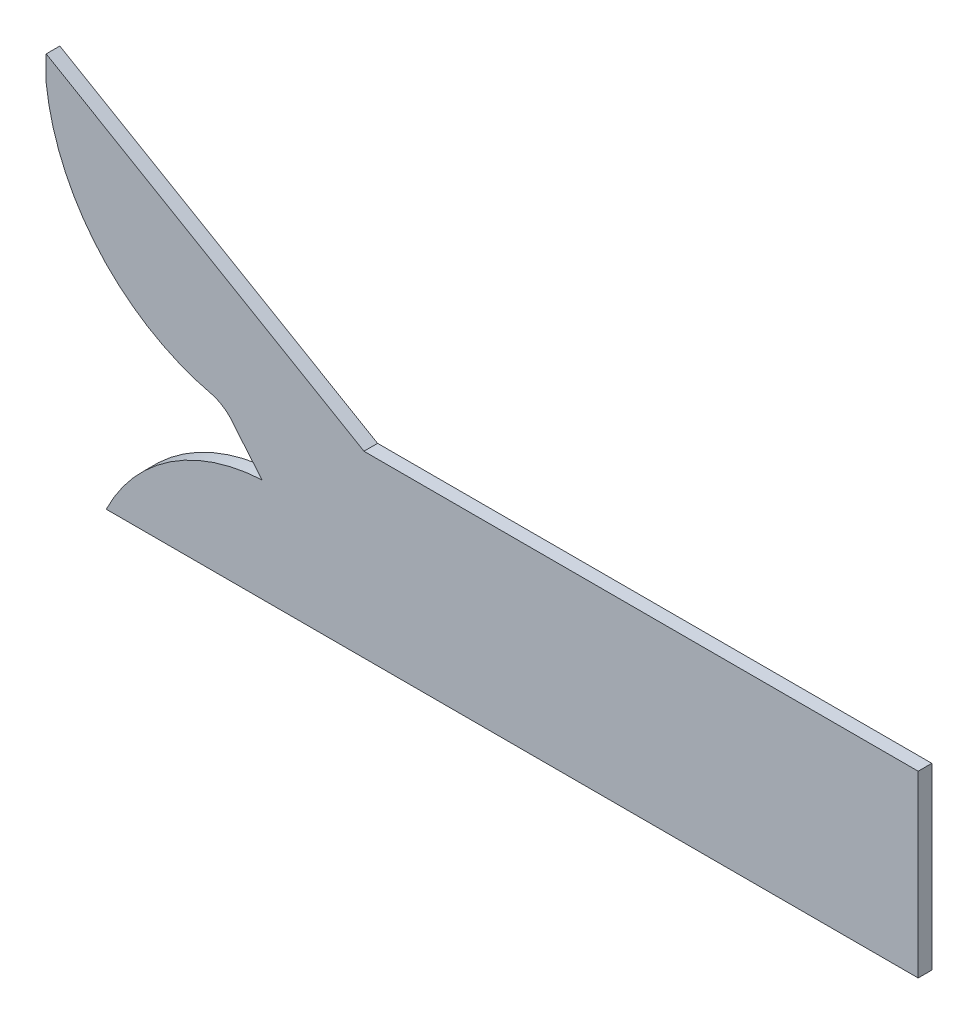
ISO-10303-21;
HEADER;
FILE_DESCRIPTION(('STEP AP214'),'2;1');
FILE_NAME('part.step','',(''),(''),'','','');
FILE_SCHEMA(('AUTOMOTIVE_DESIGN { 1 0 10303 214 1 1 1 1 }'));
ENDSEC;
DATA;
#1=APPLICATION_CONTEXT('core data for automotive mechanical design processes');
#2=APPLICATION_PROTOCOL_DEFINITION('international standard','automotive_design',2000,#1);
#3=PRODUCT_CONTEXT('',#1,'mechanical');
#4=PRODUCT('Part','Part','',(#3));
#5=PRODUCT_RELATED_PRODUCT_CATEGORY('part','',(#4));
#6=PRODUCT_DEFINITION_FORMATION('','',#4);
#7=PRODUCT_DEFINITION_CONTEXT('part definition',#1,'design');
#8=PRODUCT_DEFINITION('design','',#6,#7);
#9=PRODUCT_DEFINITION_SHAPE('','',#8);
#10=(LENGTH_UNIT() NAMED_UNIT(*) SI_UNIT(.MILLI.,.METRE.));
#11=(NAMED_UNIT(*) PLANE_ANGLE_UNIT() SI_UNIT($,.RADIAN.));
#12=(NAMED_UNIT(*) SI_UNIT($,.STERADIAN.) SOLID_ANGLE_UNIT());
#13=UNCERTAINTY_MEASURE_WITH_UNIT(LENGTH_MEASURE(1.E-05),#10,'distance_accuracy_value','');
#14=(GEOMETRIC_REPRESENTATION_CONTEXT(3) GLOBAL_UNCERTAINTY_ASSIGNED_CONTEXT((#13)) GLOBAL_UNIT_ASSIGNED_CONTEXT((#10,
#11,#12)) REPRESENTATION_CONTEXT('',''));
#15=CARTESIAN_POINT('',(0.,0.,0.));
#16=DIRECTION('',(0.,0.,1.));
#17=DIRECTION('',(1.,0.,0.));
#18=AXIS2_PLACEMENT_3D('',#15,#16,#17);
#19=CARTESIAN_POINT('',(-1456.5,672.75,33.45));
#20=DIRECTION('',(1.,0.,0.));
#21=DIRECTION('',(0.,1.,0.));
#22=AXIS2_PLACEMENT_3D('',#19,#20,#21);
#23=PLANE('',#22);
#24=DIRECTION('',(0.,0.,1.));
#25=VECTOR('',#24,1.);
#26=CARTESIAN_POINT('',(-1456.5,611.282881012337,3.17801340798951E-12));
#27=LINE('',#26,#25);
#28=CARTESIAN_POINT('',(-1456.5,611.282881012335,33.45));
#29=VERTEX_POINT('',#28);
#30=CARTESIAN_POINT('',(-1456.5,611.282881012337,-5.13246526796551E-13));
#31=VERTEX_POINT('',#30);
#32=EDGE_CURVE('E96',#29,#31,#27,.F.);
#33=ORIENTED_EDGE('',*,*,#32,.F.);
#34=DIRECTION('',(0.,-1.,0.));
#35=VECTOR('',#34,1.);
#36=CARTESIAN_POINT('',(-1456.5,672.75,33.45));
#37=LINE('',#36,#35);
#38=CARTESIAN_POINT('',(-1456.5,672.75,33.45));
#39=VERTEX_POINT('',#38);
#40=EDGE_CURVE('E147',#39,#29,#37,.T.);
#41=ORIENTED_EDGE('',*,*,#40,.F.);
#42=DIRECTION('',(0.,0.,-1.));
#43=VECTOR('',#42,1.);
#44=CARTESIAN_POINT('',(-1456.5,672.75,33.45));
#45=LINE('',#44,#43);
#46=CARTESIAN_POINT('',(-1456.5,672.75,0.));
#47=VERTEX_POINT('',#46);
#48=EDGE_CURVE('E144',#39,#47,#45,.T.);
#49=ORIENTED_EDGE('',*,*,#48,.T.);
#50=DIRECTION('',(0.,-1.,0.));
#51=VECTOR('',#50,1.);
#52=CARTESIAN_POINT('',(-1456.5,672.75,0.));
#53=LINE('',#52,#51);
#54=EDGE_CURVE('E218',#47,#31,#53,.T.);
#55=ORIENTED_EDGE('',*,*,#54,.T.);
#56=EDGE_LOOP('',(#33,#41,#49,#55));
#57=FACE_BOUND('',#56,.T.);
#58=ADVANCED_FACE('F46',(#57),#23,.F.);
#59=CARTESIAN_POINT('',(678.5,219.25,33.45));
#60=DIRECTION('',(-1.,0.,0.));
#61=DIRECTION('',(0.,-1.,0.));
#62=AXIS2_PLACEMENT_3D('',#59,#60,#61);
#63=PLANE('',#62);
#64=DIRECTION('',(0.,1.,0.));
#65=VECTOR('',#64,1.);
#66=CARTESIAN_POINT('',(678.5,219.25,0.));
#67=LINE('',#66,#65);
#68=CARTESIAN_POINT('',(678.5,-219.25,0.));
#69=VERTEX_POINT('',#68);
#70=CARTESIAN_POINT('',(678.5,219.25,0.));
#71=VERTEX_POINT('',#70);
#72=EDGE_CURVE('E211',#69,#71,#67,.T.);
#73=ORIENTED_EDGE('',*,*,#72,.T.);
#74=DIRECTION('',(0.,0.,-1.));
#75=VECTOR('',#74,1.);
#76=CARTESIAN_POINT('',(678.5,219.25,33.45));
#77=LINE('',#76,#75);
#78=CARTESIAN_POINT('',(678.5,219.25,33.45));
#79=VERTEX_POINT('',#78);
#80=EDGE_CURVE('E223',#79,#71,#77,.T.);
#81=ORIENTED_EDGE('',*,*,#80,.F.);
#82=DIRECTION('',(0.,1.,0.));
#83=VECTOR('',#82,1.);
#84=CARTESIAN_POINT('',(678.5,219.25,33.45));
#85=LINE('',#84,#83);
#86=CARTESIAN_POINT('',(678.5,-219.25,33.45));
#87=VERTEX_POINT('',#86);
#88=EDGE_CURVE('E128',#87,#79,#85,.T.);
#89=ORIENTED_EDGE('',*,*,#88,.F.);
#90=DIRECTION('',(0.,0.,-1.));
#91=VECTOR('',#90,1.);
#92=CARTESIAN_POINT('',(678.5,-219.25,33.45));
#93=LINE('',#92,#91);
#94=EDGE_CURVE('E216',#87,#69,#93,.T.);
#95=ORIENTED_EDGE('',*,*,#94,.T.);
#96=EDGE_LOOP('',(#73,#81,#89,#95));
#97=FACE_BOUND('',#96,.T.);
#98=ADVANCED_FACE('F230',(#97),#63,.F.);
#99=CARTESIAN_POINT('',(-678.5,219.25,33.45));
#100=DIRECTION('',(0.,-1.,0.));
#101=DIRECTION('',(0.,0.,-1.));
#102=AXIS2_PLACEMENT_3D('',#99,#100,#101);
#103=PLANE('',#102);
#104=DIRECTION('',(-1.,0.,0.));
#105=VECTOR('',#104,1.);
#106=CARTESIAN_POINT('',(-678.5,219.25,0.));
#107=LINE('',#106,#105);
#108=CARTESIAN_POINT('',(-678.5,219.25,0.));
#109=VERTEX_POINT('',#108);
#110=EDGE_CURVE('E105',#71,#109,#107,.T.);
#111=ORIENTED_EDGE('',*,*,#110,.T.);
#112=DIRECTION('',(0.,0.,-1.));
#113=VECTOR('',#112,1.);
#114=CARTESIAN_POINT('',(-678.5,219.25,33.45));
#115=LINE('',#114,#113);
#116=CARTESIAN_POINT('',(-678.5,219.25,33.45));
#117=VERTEX_POINT('',#116);
#118=EDGE_CURVE('E134',#117,#109,#115,.T.);
#119=ORIENTED_EDGE('',*,*,#118,.F.);
#120=DIRECTION('',(-1.,0.,0.));
#121=VECTOR('',#120,1.);
#122=CARTESIAN_POINT('',(-678.5,219.25,33.45));
#123=LINE('',#122,#121);
#124=EDGE_CURVE('E121',#79,#117,#123,.T.);
#125=ORIENTED_EDGE('',*,*,#124,.F.);
#126=ORIENTED_EDGE('',*,*,#80,.T.);
#127=EDGE_LOOP('',(#111,#119,#125,#126));
#128=FACE_BOUND('',#127,.T.);
#129=ADVANCED_FACE('F135',(#128),#103,.F.);
#130=CARTESIAN_POINT('',(-678.5,219.25,33.45));
#131=DIRECTION('',(-0.503594822523907,-0.863939960140237,0.));
#132=DIRECTION('',(0.863939960140237,-0.503594822523907,0.));
#133=AXIS2_PLACEMENT_3D('',#130,#131,#132);
#134=PLANE('',#133);
#135=DIRECTION('',(-0.863939960140237,0.503594822523907,0.));
#136=VECTOR('',#135,1.);
#137=CARTESIAN_POINT('',(-678.5,219.25,0.));
#138=LINE('',#137,#136);
#139=EDGE_CURVE('E140',#109,#47,#138,.T.);
#140=ORIENTED_EDGE('',*,*,#139,.T.);
#141=ORIENTED_EDGE('',*,*,#48,.F.);
#142=DIRECTION('',(-0.863939960140237,0.503594822523907,0.));
#143=VECTOR('',#142,1.);
#144=CARTESIAN_POINT('',(-678.5,219.25,33.45));
#145=LINE('',#144,#143);
#146=EDGE_CURVE('E125',#117,#39,#145,.T.);
#147=ORIENTED_EDGE('',*,*,#146,.F.);
#148=ORIENTED_EDGE('',*,*,#118,.T.);
#149=EDGE_LOOP('',(#140,#141,#147,#148));
#150=FACE_BOUND('',#149,.T.);
#151=ADVANCED_FACE('F142',(#150),#134,.F.);
#152=CARTESIAN_POINT('',(-678.5,-219.25,33.45));
#153=DIRECTION('',(0.,1.,0.));
#154=DIRECTION('',(0.,0.,1.));
#155=AXIS2_PLACEMENT_3D('',#152,#153,#154);
#156=PLANE('',#155);
#157=DIRECTION('',(1.,0.,0.));
#158=VECTOR('',#157,1.);
#159=CARTESIAN_POINT('',(-1456.5,-219.25,33.45));
#160=LINE('',#159,#158);
#161=CARTESIAN_POINT('',(-1309.43889327958,-219.25,33.45));
#162=VERTEX_POINT('',#161);
#163=EDGE_CURVE('E155',#162,#87,#160,.T.);
#164=ORIENTED_EDGE('',*,*,#163,.F.);
#165=DIRECTION('',(0.,0.,1.));
#166=VECTOR('',#165,1.);
#167=CARTESIAN_POINT('',(-1309.43889327958,-219.25,-0.00100000000051448));
#168=LINE('',#167,#166);
#169=CARTESIAN_POINT('',(-1309.43889327958,-219.25,0.));
#170=VERTEX_POINT('',#169);
#171=EDGE_CURVE('E199',#170,#162,#168,.T.);
#172=ORIENTED_EDGE('',*,*,#171,.F.);
#173=DIRECTION('',(1.,0.,0.));
#174=VECTOR('',#173,1.);
#175=CARTESIAN_POINT('',(-678.5,-219.25,0.));
#176=LINE('',#175,#174);
#177=EDGE_CURVE('E139',#170,#69,#176,.T.);
#178=ORIENTED_EDGE('',*,*,#177,.T.);
#179=ORIENTED_EDGE('',*,*,#94,.F.);
#180=EDGE_LOOP('',(#164,#172,#178,#179));
#181=FACE_BOUND('',#180,.T.);
#182=ADVANCED_FACE('F205',(#181),#156,.F.);
#183=CARTESIAN_POINT('',(0.,0.,33.45));
#184=DIRECTION('',(0.,0.,1.));
#185=DIRECTION('',(1.,0.,0.));
#186=AXIS2_PLACEMENT_3D('',#183,#184,#185);
#187=PLANE('',#186);
#188=CARTESIAN_POINT('',(-904.577879876999,-415.687165085005,33.45));
#189=DIRECTION('',(0.,0.,1.));
#190=DIRECTION('',(1.,0.,0.));
#191=AXIS2_PLACEMENT_3D('',#188,#189,#190);
#192=CIRCLE('',#191,450.);
#193=CARTESIAN_POINT('',(-927.890567991816,33.7085609436943,33.45));
#194=VERTEX_POINT('',#193);
#195=EDGE_CURVE('E80',#194,#162,#192,.T.);
#196=ORIENTED_EDGE('',*,*,#195,.T.);
#197=ORIENTED_EDGE('',*,*,#163,.T.);
#198=ORIENTED_EDGE('',*,*,#88,.T.);
#199=ORIENTED_EDGE('',*,*,#124,.T.);
#200=ORIENTED_EDGE('',*,*,#146,.T.);
#201=ORIENTED_EDGE('',*,*,#40,.T.);
#202=CARTESIAN_POINT('',(-927.890567991816,671.250108662018,33.45));
#203=DIRECTION('',(0.,0.,1.));
#204=DIRECTION('',(1.,0.,0.));
#205=AXIS2_PLACEMENT_3D('',#202,#203,#204);
#206=CIRCLE('',#205,532.);
#207=CARTESIAN_POINT('',(-1048.42198546556,153.083940911006,33.45));
#208=VERTEX_POINT('',#207);
#209=EDGE_CURVE('E88',#29,#208,#206,.T.);
#210=ORIENTED_EDGE('',*,*,#209,.T.);
#211=CARTESIAN_POINT('',(-1077.81105857191,57.5000385950307,33.45));
#212=DIRECTION('',(0.,0.,1.));
#213=DIRECTION('',(1.,0.,0.));
#214=AXIS2_PLACEMENT_3D('',#211,#212,#213);
#215=CIRCLE('',#214,100.);
#216=CARTESIAN_POINT('',(-994.109648548166,112.218170507932,33.45));
#217=VERTEX_POINT('',#216);
#218=EDGE_CURVE('E163',#208,#217,#215,.F.);
#219=ORIENTED_EDGE('',*,*,#218,.T.);
#220=DIRECTION('',(0.644737828666312,-0.764403775688379,0.));
#221=VECTOR('',#220,1.);
#222=CARTESIAN_POINT('',(-525.565715996857,-443.28940977315,33.45));
#223=LINE('',#222,#221);
#224=EDGE_CURVE('E65',#217,#194,#223,.T.);
#225=ORIENTED_EDGE('',*,*,#224,.T.);
#226=EDGE_LOOP('',(#196,#197,#198,#199,#200,#201,#210,#219,#225));
#227=FACE_BOUND('',#226,.T.);
#228=ADVANCED_FACE('F48',(#227),#187,.T.);
#229=CARTESIAN_POINT('',(0.,0.,0.));
#230=DIRECTION('',(0.,0.,1.));
#231=DIRECTION('',(1.,0.,0.));
#232=AXIS2_PLACEMENT_3D('',#229,#230,#231);
#233=PLANE('',#232);
#234=ORIENTED_EDGE('',*,*,#177,.F.);
#235=CARTESIAN_POINT('',(-904.577879876999,-415.687165085005,3.34454686168328E-12));
#236=DIRECTION('',(0.,0.,1.));
#237=DIRECTION('',(1.,0.,0.));
#238=AXIS2_PLACEMENT_3D('',#235,#236,#237);
#239=CIRCLE('',#238,450.);
#240=CARTESIAN_POINT('',(-927.890567991816,33.7085609436943,3.17801340798951E-12));
#241=VERTEX_POINT('',#240);
#242=EDGE_CURVE('E50',#241,#170,#239,.T.);
#243=ORIENTED_EDGE('',*,*,#242,.F.);
#244=DIRECTION('',(0.644737828666312,-0.764403775688379,0.));
#245=VECTOR('',#244,1.);
#246=CARTESIAN_POINT('',(-994.109648548166,112.218170507932,2.72004641033163E-12));
#247=LINE('',#246,#245);
#248=CARTESIAN_POINT('',(-994.109648548166,112.218170507932,0.));
#249=VERTEX_POINT('',#248);
#250=EDGE_CURVE('E57',#249,#241,#247,.T.);
#251=ORIENTED_EDGE('',*,*,#250,.F.);
#252=CARTESIAN_POINT('',(-1077.81105857191,57.5000385950307,2.13024042849952E-12));
#253=DIRECTION('',(0.,0.,-1.));
#254=DIRECTION('',(-1.,0.,0.));
#255=AXIS2_PLACEMENT_3D('',#252,#253,#254);
#256=CIRCLE('',#255,100.);
#257=CARTESIAN_POINT('',(-1048.42198546556,153.083940911006,2.33840724561674E-12));
#258=VERTEX_POINT('',#257);
#259=EDGE_CURVE('E174',#258,#249,#256,.T.);
#260=ORIENTED_EDGE('',*,*,#259,.F.);
#261=CARTESIAN_POINT('',(-927.890567991816,671.250108662018,3.17801340798951E-12));
#262=DIRECTION('',(0.,0.,1.));
#263=DIRECTION('',(1.,0.,0.));
#264=AXIS2_PLACEMENT_3D('',#261,#262,#263);
#265=CIRCLE('',#264,532.);
#266=EDGE_CURVE('E160',#31,#258,#265,.T.);
#267=ORIENTED_EDGE('',*,*,#266,.F.);
#268=ORIENTED_EDGE('',*,*,#54,.F.);
#269=ORIENTED_EDGE('',*,*,#139,.F.);
#270=ORIENTED_EDGE('',*,*,#110,.F.);
#271=ORIENTED_EDGE('',*,*,#72,.F.);
#272=EDGE_LOOP('',(#234,#243,#251,#260,#267,#268,#269,#270,#271));
#273=FACE_BOUND('',#272,.T.);
#274=ADVANCED_FACE('F190',(#273),#233,.F.);
#275=CARTESIAN_POINT('',(-927.890567991816,671.250108662018,3.17801340798951E-12));
#276=DIRECTION('',(0.,0.,1.));
#277=DIRECTION('',(1.,0.,0.));
#278=AXIS2_PLACEMENT_3D('',#275,#276,#277);
#279=CYLINDRICAL_SURFACE('',#278,532.);
#280=ORIENTED_EDGE('',*,*,#32,.T.);
#281=ORIENTED_EDGE('',*,*,#266,.T.);
#282=DIRECTION('',(0.,0.,1.));
#283=VECTOR('',#282,1.);
#284=CARTESIAN_POINT('',(-1048.42198546556,153.083940911006,2.33840724561674E-12));
#285=LINE('',#284,#283);
#286=EDGE_CURVE('E169',#258,#208,#285,.T.);
#287=ORIENTED_EDGE('',*,*,#286,.T.);
#288=ORIENTED_EDGE('',*,*,#209,.F.);
#289=EDGE_LOOP('',(#280,#281,#287,#288));
#290=FACE_BOUND('',#289,.T.);
#291=ADVANCED_FACE('F182',(#290),#279,.T.);
#292=CARTESIAN_POINT('',(-904.577879876999,-415.687165085005,3.34454686168328E-12));
#293=DIRECTION('',(0.,0.,1.));
#294=DIRECTION('',(1.,0.,0.));
#295=AXIS2_PLACEMENT_3D('',#292,#293,#294);
#296=CYLINDRICAL_SURFACE('',#295,450.);
#297=DIRECTION('',(0.,0.,1.));
#298=VECTOR('',#297,1.);
#299=CARTESIAN_POINT('',(-927.890567991816,33.7085609436943,3.17801340798951E-12));
#300=LINE('',#299,#298);
#301=EDGE_CURVE('E12',#241,#194,#300,.T.);
#302=ORIENTED_EDGE('',*,*,#301,.F.);
#303=ORIENTED_EDGE('',*,*,#242,.T.);
#304=ORIENTED_EDGE('',*,*,#171,.T.);
#305=ORIENTED_EDGE('',*,*,#195,.F.);
#306=EDGE_LOOP('',(#302,#303,#304,#305));
#307=FACE_BOUND('',#306,.T.);
#308=ADVANCED_FACE('F195',(#307),#296,.T.);
#309=CARTESIAN_POINT('',(-1077.81105857191,57.5000385950307,2.13024042849952E-12));
#310=DIRECTION('',(0.,0.,1.));
#311=DIRECTION('',(1.,0.,0.));
#312=AXIS2_PLACEMENT_3D('',#309,#310,#311);
#313=CYLINDRICAL_SURFACE('',#312,100.);
#314=ORIENTED_EDGE('',*,*,#286,.F.);
#315=ORIENTED_EDGE('',*,*,#259,.T.);
#316=DIRECTION('',(0.,0.,1.));
#317=VECTOR('',#316,1.);
#318=CARTESIAN_POINT('',(-994.109648548166,112.218170507932,2.72004641033163E-12));
#319=LINE('',#318,#317);
#320=EDGE_CURVE('E172',#249,#217,#319,.T.);
#321=ORIENTED_EDGE('',*,*,#320,.T.);
#322=ORIENTED_EDGE('',*,*,#218,.F.);
#323=EDGE_LOOP('',(#314,#315,#321,#322));
#324=FACE_BOUND('',#323,.T.);
#325=ADVANCED_FACE('F187',(#324),#313,.F.);
#326=CARTESIAN_POINT('',(-994.109648548166,112.218170507932,2.72004641033163E-12));
#327=DIRECTION('',(-0.764403775688379,-0.644737828666312,0.));
#328=DIRECTION('',(-0.644737828666312,0.764403775688379,0.));
#329=AXIS2_PLACEMENT_3D('',#326,#327,#328);
#330=PLANE('',#329);
#331=ORIENTED_EDGE('',*,*,#320,.F.);
#332=ORIENTED_EDGE('',*,*,#250,.T.);
#333=ORIENTED_EDGE('',*,*,#301,.T.);
#334=ORIENTED_EDGE('',*,*,#224,.F.);
#335=EDGE_LOOP('',(#331,#332,#333,#334));
#336=FACE_BOUND('',#335,.T.);
#337=ADVANCED_FACE('F194',(#336),#330,.T.);
#338=CLOSED_SHELL('',(#58,#98,#129,#151,#182,#228,#274,#291,#308,#325,#337));
#339=MANIFOLD_SOLID_BREP('B2',#338);
#340=ADVANCED_BREP_SHAPE_REPRESENTATION('',(#18,#339),#14);
#341=SHAPE_DEFINITION_REPRESENTATION(#9,#340);
ENDSEC;
END-ISO-10303-21;
